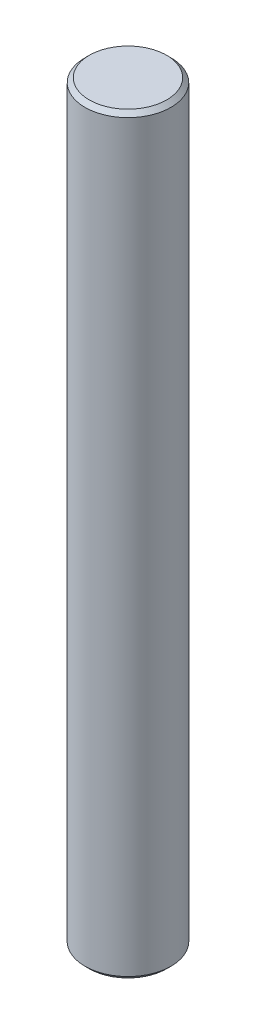
ISO-10303-21;
HEADER;
FILE_DESCRIPTION(('STEP AP214'),'2;1');
FILE_NAME('part.step','',(''),(''),'','','');
FILE_SCHEMA(('AUTOMOTIVE_DESIGN { 1 0 10303 214 1 1 1 1 }'));
ENDSEC;
DATA;
#1=APPLICATION_CONTEXT('core data for automotive mechanical design processes');
#2=APPLICATION_PROTOCOL_DEFINITION('international standard','automotive_design',2000,#1);
#3=PRODUCT_CONTEXT('',#1,'mechanical');
#4=PRODUCT('Part','Part','',(#3));
#5=PRODUCT_RELATED_PRODUCT_CATEGORY('part','',(#4));
#6=PRODUCT_DEFINITION_FORMATION('','',#4);
#7=PRODUCT_DEFINITION_CONTEXT('part definition',#1,'design');
#8=PRODUCT_DEFINITION('design','',#6,#7);
#9=PRODUCT_DEFINITION_SHAPE('','',#8);
#10=(LENGTH_UNIT() NAMED_UNIT(*) SI_UNIT(.MILLI.,.METRE.));
#11=(NAMED_UNIT(*) PLANE_ANGLE_UNIT() SI_UNIT($,.RADIAN.));
#12=(NAMED_UNIT(*) SI_UNIT($,.STERADIAN.) SOLID_ANGLE_UNIT());
#13=UNCERTAINTY_MEASURE_WITH_UNIT(LENGTH_MEASURE(1.E-05),#10,'distance_accuracy_value','');
#14=(GEOMETRIC_REPRESENTATION_CONTEXT(3) GLOBAL_UNCERTAINTY_ASSIGNED_CONTEXT((#13)) GLOBAL_UNIT_ASSIGNED_CONTEXT((#10,
#11,#12)) REPRESENTATION_CONTEXT('',''));
#15=CARTESIAN_POINT('',(0.,0.,0.));
#16=DIRECTION('',(0.,0.,1.));
#17=DIRECTION('',(1.,0.,0.));
#18=AXIS2_PLACEMENT_3D('',#15,#16,#17);
#19=CARTESIAN_POINT('',(0.,35.,0.));
#20=DIRECTION('',(0.,-1.,0.));
#21=DIRECTION('',(0.,0.,-1.));
#22=AXIS2_PLACEMENT_3D('',#19,#20,#21);
#23=CYLINDRICAL_SURFACE('',#22,2.);
#24=CARTESIAN_POINT('',(0.,34.8,0.));
#25=DIRECTION('',(0.,1.,0.));
#26=DIRECTION('',(0.,0.,1.));
#27=AXIS2_PLACEMENT_3D('',#24,#25,#26);
#28=CIRCLE('',#27,2.);
#29=CARTESIAN_POINT('',(0.,34.8,2.));
#30=VERTEX_POINT('',#29);
#31=EDGE_CURVE('E50',#30,#30,#28,.F.);
#32=ORIENTED_EDGE('',*,*,#31,.T.);
#33=EDGE_LOOP('',(#32));
#34=FACE_BOUND('',#33,.T.);
#35=CARTESIAN_POINT('',(0.,0.199999999999999,0.));
#36=DIRECTION('',(0.,1.,0.));
#37=DIRECTION('',(0.,0.,1.));
#38=AXIS2_PLACEMENT_3D('',#35,#36,#37);
#39=CIRCLE('',#38,2.);
#40=CARTESIAN_POINT('',(0.,0.199999999999999,2.));
#41=VERTEX_POINT('',#40);
#42=EDGE_CURVE('E55',#41,#41,#39,.T.);
#43=ORIENTED_EDGE('',*,*,#42,.T.);
#44=EDGE_LOOP('',(#43));
#45=FACE_BOUND('',#44,.T.);
#46=ADVANCED_FACE('F41',(#34,#45),#23,.T.);
#47=CARTESIAN_POINT('',(0.,35.,0.));
#48=DIRECTION('',(0.,1.,0.));
#49=DIRECTION('',(0.,0.,1.));
#50=AXIS2_PLACEMENT_3D('',#47,#48,#49);
#51=PLANE('',#50);
#52=CARTESIAN_POINT('',(0.,35.,0.));
#53=DIRECTION('',(0.,1.,0.));
#54=DIRECTION('',(0.,0.,1.));
#55=AXIS2_PLACEMENT_3D('',#52,#53,#54);
#56=CIRCLE('',#55,1.8);
#57=CARTESIAN_POINT('',(0.,35.,1.8));
#58=VERTEX_POINT('',#57);
#59=EDGE_CURVE('E60',#58,#58,#56,.T.);
#60=ORIENTED_EDGE('',*,*,#59,.T.);
#61=EDGE_LOOP('',(#60));
#62=FACE_BOUND('',#61,.T.);
#63=ADVANCED_FACE('F67',(#62),#51,.T.);
#64=CARTESIAN_POINT('',(0.,0.,0.));
#65=DIRECTION('',(0.,1.,0.));
#66=DIRECTION('',(0.,0.,1.));
#67=AXIS2_PLACEMENT_3D('',#64,#65,#66);
#68=PLANE('',#67);
#69=CARTESIAN_POINT('',(0.,0.,0.));
#70=DIRECTION('',(0.,1.,0.));
#71=DIRECTION('',(0.,0.,1.));
#72=AXIS2_PLACEMENT_3D('',#69,#70,#71);
#73=CIRCLE('',#72,1.8);
#74=CARTESIAN_POINT('',(0.,0.,1.8));
#75=VERTEX_POINT('',#74);
#76=EDGE_CURVE('E10',#75,#75,#73,.F.);
#77=ORIENTED_EDGE('',*,*,#76,.T.);
#78=EDGE_LOOP('',(#77));
#79=FACE_BOUND('',#78,.T.);
#80=ADVANCED_FACE('F71',(#79),#68,.F.);
#81=CARTESIAN_POINT('',(0.,35.,0.));
#82=DIRECTION('',(0.,-1.,0.));
#83=DIRECTION('',(0.,0.,-1.));
#84=AXIS2_PLACEMENT_3D('',#81,#82,#83);
#85=CONICAL_SURFACE('',#84,1.8,0.785398163397453);
#86=ORIENTED_EDGE('',*,*,#31,.F.);
#87=EDGE_LOOP('',(#86));
#88=FACE_BOUND('',#87,.T.);
#89=ORIENTED_EDGE('',*,*,#59,.F.);
#90=EDGE_LOOP('',(#89));
#91=FACE_BOUND('',#90,.T.);
#92=ADVANCED_FACE('F69',(#88,#91),#85,.T.);
#93=CARTESIAN_POINT('',(0.,0.199999999999999,0.));
#94=DIRECTION('',(0.,1.,0.));
#95=DIRECTION('',(0.,0.,1.));
#96=AXIS2_PLACEMENT_3D('',#93,#94,#95);
#97=CONICAL_SURFACE('',#96,2.,0.785398163397453);
#98=ORIENTED_EDGE('',*,*,#76,.F.);
#99=EDGE_LOOP('',(#98));
#100=FACE_BOUND('',#99,.T.);
#101=ORIENTED_EDGE('',*,*,#42,.F.);
#102=EDGE_LOOP('',(#101));
#103=FACE_BOUND('',#102,.T.);
#104=ADVANCED_FACE('F44',(#100,#103),#97,.T.);
#105=CLOSED_SHELL('',(#46,#63,#80,#92,#104));
#106=MANIFOLD_SOLID_BREP('B2',#105);
#107=ADVANCED_BREP_SHAPE_REPRESENTATION('',(#18,#106),#14);
#108=SHAPE_DEFINITION_REPRESENTATION(#9,#107);
ENDSEC;
END-ISO-10303-21;
